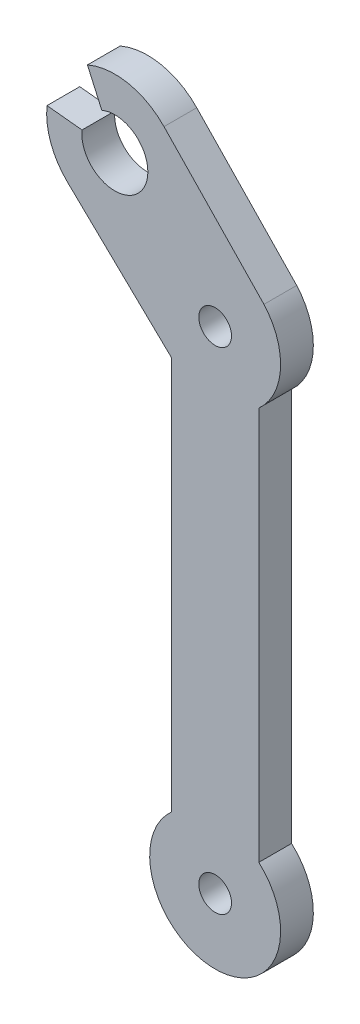
ISO-10303-21;
HEADER;
FILE_DESCRIPTION(('STEP AP214'),'2;1');
FILE_NAME('part.step','',(''),(''),'','','');
FILE_SCHEMA(('AUTOMOTIVE_DESIGN { 1 0 10303 214 1 1 1 1 }'));
ENDSEC;
DATA;
#1=APPLICATION_CONTEXT('core data for automotive mechanical design processes');
#2=APPLICATION_PROTOCOL_DEFINITION('international standard','automotive_design',2000,#1);
#3=PRODUCT_CONTEXT('',#1,'mechanical');
#4=PRODUCT('Part','Part','',(#3));
#5=PRODUCT_RELATED_PRODUCT_CATEGORY('part','',(#4));
#6=PRODUCT_DEFINITION_FORMATION('','',#4);
#7=PRODUCT_DEFINITION_CONTEXT('part definition',#1,'design');
#8=PRODUCT_DEFINITION('design','',#6,#7);
#9=PRODUCT_DEFINITION_SHAPE('','',#8);
#10=(LENGTH_UNIT() NAMED_UNIT(*) SI_UNIT(.MILLI.,.METRE.));
#11=(NAMED_UNIT(*) PLANE_ANGLE_UNIT() SI_UNIT($,.RADIAN.));
#12=(NAMED_UNIT(*) SI_UNIT($,.STERADIAN.) SOLID_ANGLE_UNIT());
#13=UNCERTAINTY_MEASURE_WITH_UNIT(LENGTH_MEASURE(1.E-05),#10,'distance_accuracy_value','');
#14=(GEOMETRIC_REPRESENTATION_CONTEXT(3) GLOBAL_UNCERTAINTY_ASSIGNED_CONTEXT((#13)) GLOBAL_UNIT_ASSIGNED_CONTEXT((#10,
#11,#12)) REPRESENTATION_CONTEXT('',''));
#15=CARTESIAN_POINT('',(0.,0.,0.));
#16=DIRECTION('',(0.,0.,1.));
#17=DIRECTION('',(1.,0.,0.));
#18=AXIS2_PLACEMENT_3D('',#15,#16,#17);
#19=CARTESIAN_POINT('',(13.3453641785926,12.8339301023455,3.));
#20=DIRECTION('',(-0.720783164810605,-0.693160608607852,0.));
#21=DIRECTION('',(0.693160608607852,-0.720783164810606,0.));
#22=AXIS2_PLACEMENT_3D('',#19,#20,#21);
#23=PLANE('',#22);
#24=DIRECTION('',(-0.693160608607852,0.720783164810606,0.));
#25=VECTOR('',#24,1.);
#26=CARTESIAN_POINT('',(13.3453641785926,12.8339301023455,0.));
#27=LINE('',#26,#25);
#28=CARTESIAN_POINT('',(-1.96661843254442,28.7560975609757,0.));
#29=VERTEX_POINT('',#28);
#30=CARTESIAN_POINT('',(-11.1262477629027,38.2807395201999,0.));
#31=VERTEX_POINT('',#30);
#32=EDGE_CURVE('E156',#29,#31,#27,.T.);
#33=ORIENTED_EDGE('',*,*,#32,.T.);
#34=DIRECTION('',(0.,0.,-1.));
#35=VECTOR('',#34,1.);
#36=CARTESIAN_POINT('',(-11.1262477629027,38.2807395201999,3.));
#37=LINE('',#36,#35);
#38=CARTESIAN_POINT('',(-11.1262477629027,38.2807395201999,3.));
#39=VERTEX_POINT('',#38);
#40=EDGE_CURVE('E11',#39,#31,#37,.T.);
#41=ORIENTED_EDGE('',*,*,#40,.F.);
#42=DIRECTION('',(-0.693160608607852,0.720783164810606,0.));
#43=VECTOR('',#42,1.);
#44=CARTESIAN_POINT('',(13.3453641785926,12.8339301023455,3.));
#45=LINE('',#44,#43);
#46=CARTESIAN_POINT('',(-1.96661843254442,28.7560975609757,3.));
#47=VERTEX_POINT('',#46);
#48=EDGE_CURVE('E217',#47,#39,#45,.T.);
#49=ORIENTED_EDGE('',*,*,#48,.F.);
#50=DIRECTION('',(0.,0.,-1.));
#51=VECTOR('',#50,1.);
#52=CARTESIAN_POINT('',(-1.96661843254442,28.7560975609757,3.));
#53=LINE('',#52,#51);
#54=EDGE_CURVE('E146',#47,#29,#53,.T.);
#55=ORIENTED_EDGE('',*,*,#54,.T.);
#56=EDGE_LOOP('',(#33,#41,#49,#55));
#57=FACE_BOUND('',#56,.T.);
#58=ADVANCED_FACE('F35',(#57),#23,.F.);
#59=CARTESIAN_POINT('',(-15.6311425429689,33.9484857164008,3.));
#60=DIRECTION('',(0.,0.,-1.));
#61=DIRECTION('',(-1.,0.,0.));
#62=AXIS2_PLACEMENT_3D('',#59,#60,#61);
#63=CYLINDRICAL_SURFACE('',#62,6.25);
#64=CARTESIAN_POINT('',(-15.6311425429689,33.9484857164008,0.));
#65=DIRECTION('',(0.,0.,1.));
#66=DIRECTION('',(1.,0.,0.));
#67=AXIS2_PLACEMENT_3D('',#64,#65,#66);
#68=CIRCLE('',#67,6.25);
#69=CARTESIAN_POINT('',(-18.1431981071145,39.6714287392384,0.));
#70=VERTEX_POINT('',#69);
#71=EDGE_CURVE('E159',#31,#70,#68,.T.);
#72=ORIENTED_EDGE('',*,*,#71,.T.);
#73=DIRECTION('',(0.,0.,-1.));
#74=VECTOR('',#73,1.);
#75=CARTESIAN_POINT('',(-18.1431981071145,39.6714287392384,3.));
#76=LINE('',#75,#74);
#77=CARTESIAN_POINT('',(-18.1431981071145,39.6714287392384,3.));
#78=VERTEX_POINT('',#77);
#79=EDGE_CURVE('E44',#78,#70,#76,.T.);
#80=ORIENTED_EDGE('',*,*,#79,.F.);
#81=CARTESIAN_POINT('',(-15.6311425429689,33.9484857164008,3.));
#82=DIRECTION('',(0.,0.,1.));
#83=DIRECTION('',(1.,0.,0.));
#84=AXIS2_PLACEMENT_3D('',#81,#82,#83);
#85=CIRCLE('',#84,6.25);
#86=EDGE_CURVE('E104',#39,#78,#85,.T.);
#87=ORIENTED_EDGE('',*,*,#86,.F.);
#88=ORIENTED_EDGE('',*,*,#40,.T.);
#89=EDGE_LOOP('',(#72,#80,#87,#88));
#90=FACE_BOUND('',#89,.T.);
#91=ADVANCED_FACE('F200',(#90),#63,.T.);
#92=CARTESIAN_POINT('',(-0.332401726315656,-0.14867714018544,3.));
#93=DIRECTION('',(-0.912847829342407,-0.408299939339765,0.));
#94=DIRECTION('',(0.408299939339765,-0.912847829342407,0.));
#95=AXIS2_PLACEMENT_3D('',#92,#93,#94);
#96=PLANE('',#95);
#97=DIRECTION('',(-0.408299939339765,0.912847829342407,0.));
#98=VECTOR('',#97,1.);
#99=CARTESIAN_POINT('',(-0.332401726315656,-0.14867714018544,0.));
#100=LINE('',#99,#98);
#101=CARTESIAN_POINT('',(-16.8263647417837,36.7273467952351,0.));
#102=VERTEX_POINT('',#101);
#103=EDGE_CURVE('E162',#102,#70,#100,.T.);
#104=ORIENTED_EDGE('',*,*,#103,.F.);
#105=DIRECTION('',(0.,0.,-1.));
#106=VECTOR('',#105,1.);
#107=CARTESIAN_POINT('',(-16.8263647417837,36.7273467952351,3.));
#108=LINE('',#107,#106);
#109=CARTESIAN_POINT('',(-16.8263647417837,36.7273467952351,3.));
#110=VERTEX_POINT('',#109);
#111=EDGE_CURVE('E193',#110,#102,#108,.T.);
#112=ORIENTED_EDGE('',*,*,#111,.F.);
#113=DIRECTION('',(-0.408299939339765,0.912847829342407,0.));
#114=VECTOR('',#113,1.);
#115=CARTESIAN_POINT('',(-0.332401726315656,-0.14867714018544,3.));
#116=LINE('',#115,#114);
#117=EDGE_CURVE('E199',#110,#78,#116,.T.);
#118=ORIENTED_EDGE('',*,*,#117,.T.);
#119=ORIENTED_EDGE('',*,*,#79,.T.);
#120=EDGE_LOOP('',(#104,#112,#118,#119));
#121=FACE_BOUND('',#120,.T.);
#122=ADVANCED_FACE('F197',(#121),#96,.T.);
#123=CARTESIAN_POINT('',(-15.6311425429689,33.9484857164008,3.));
#124=DIRECTION('',(0.,0.,-1.));
#125=DIRECTION('',(-1.,0.,0.));
#126=AXIS2_PLACEMENT_3D('',#123,#124,#125);
#127=CYLINDRICAL_SURFACE('',#126,3.025);
#128=CARTESIAN_POINT('',(-15.6311425429689,33.9484857164008,0.));
#129=DIRECTION('',(0.,0.,1.));
#130=DIRECTION('',(1.,0.,0.));
#131=AXIS2_PLACEMENT_3D('',#128,#129,#130);
#132=CIRCLE('',#131,3.025);
#133=CARTESIAN_POINT('',(-18.6401081664704,34.2595337457897,0.));
#134=VERTEX_POINT('',#133);
#135=EDGE_CURVE('E166',#134,#102,#132,.T.);
#136=ORIENTED_EDGE('',*,*,#135,.F.);
#137=DIRECTION('',(0.,0.,-1.));
#138=VECTOR('',#137,1.);
#139=CARTESIAN_POINT('',(-18.6401081664704,34.2595337457897,3.));
#140=LINE('',#139,#138);
#141=CARTESIAN_POINT('',(-18.6401081664704,34.2595337457897,3.));
#142=VERTEX_POINT('',#141);
#143=EDGE_CURVE('E191',#142,#134,#140,.T.);
#144=ORIENTED_EDGE('',*,*,#143,.F.);
#145=CARTESIAN_POINT('',(-15.6311425429689,33.9484857164008,3.));
#146=DIRECTION('',(0.,0.,1.));
#147=DIRECTION('',(1.,0.,0.));
#148=AXIS2_PLACEMENT_3D('',#145,#146,#147);
#149=CIRCLE('',#148,3.025);
#150=EDGE_CURVE('E213',#142,#110,#149,.T.);
#151=ORIENTED_EDGE('',*,*,#150,.T.);
#152=ORIENTED_EDGE('',*,*,#111,.T.);
#153=EDGE_LOOP('',(#136,#144,#151,#152));
#154=FACE_BOUND('',#153,.T.);
#155=ADVANCED_FACE('F209',(#154),#127,.F.);
#156=CARTESIAN_POINT('',(3.30700640548946,31.9907784349738,3.));
#157=DIRECTION('',(-0.102825794839319,-0.994699379669889,0.));
#158=DIRECTION('',(0.994699379669889,-0.102825794839319,0.));
#159=AXIS2_PLACEMENT_3D('',#156,#157,#158);
#160=PLANE('',#159);
#161=DIRECTION('',(-0.994699379669889,0.102825794839319,0.));
#162=VECTOR('',#161,1.);
#163=CARTESIAN_POINT('',(3.30700640548946,31.9907784349738,0.));
#164=LINE('',#163,#162);
#165=CARTESIAN_POINT('',(-21.8480136659058,34.5911469341465,0.));
#166=VERTEX_POINT('',#165);
#167=EDGE_CURVE('E169',#134,#166,#164,.T.);
#168=ORIENTED_EDGE('',*,*,#167,.T.);
#169=DIRECTION('',(0.,0.,-1.));
#170=VECTOR('',#169,1.);
#171=CARTESIAN_POINT('',(-21.8480136659058,34.5911469341465,3.));
#172=LINE('',#171,#170);
#173=CARTESIAN_POINT('',(-21.8480136659058,34.5911469341465,3.));
#174=VERTEX_POINT('',#173);
#175=EDGE_CURVE('E188',#174,#166,#172,.T.);
#176=ORIENTED_EDGE('',*,*,#175,.F.);
#177=DIRECTION('',(-0.994699379669889,0.102825794839319,0.));
#178=VECTOR('',#177,1.);
#179=CARTESIAN_POINT('',(3.30700640548946,31.9907784349738,3.));
#180=LINE('',#179,#178);
#181=EDGE_CURVE('E215',#142,#174,#180,.T.);
#182=ORIENTED_EDGE('',*,*,#181,.F.);
#183=ORIENTED_EDGE('',*,*,#143,.T.);
#184=EDGE_LOOP('',(#168,#176,#182,#183));
#185=FACE_BOUND('',#184,.T.);
#186=ADVANCED_FACE('F330',(#185),#160,.F.);
#187=CARTESIAN_POINT('',(-19.9633963467681,29.4435909363345,0.));
#188=VERTEX_POINT('',#187);
#189=EDGE_CURVE('E163',#166,#188,#68,.T.);
#190=ORIENTED_EDGE('',*,*,#189,.T.);
#191=DIRECTION('',(0.,0.,-1.));
#192=VECTOR('',#191,1.);
#193=CARTESIAN_POINT('',(-19.9633963467681,29.4435909363345,3.));
#194=LINE('',#193,#192);
#195=CARTESIAN_POINT('',(-19.9633963467681,29.4435909363345,3.));
#196=VERTEX_POINT('',#195);
#197=EDGE_CURVE('E186',#196,#188,#194,.T.);
#198=ORIENTED_EDGE('',*,*,#197,.F.);
#199=EDGE_CURVE('E219',#174,#196,#85,.T.);
#200=ORIENTED_EDGE('',*,*,#199,.F.);
#201=ORIENTED_EDGE('',*,*,#175,.T.);
#202=EDGE_LOOP('',(#190,#198,#200,#201));
#203=FACE_BOUND('',#202,.T.);
#204=ADVANCED_FACE('F250',(#203),#63,.T.);
#205=CARTESIAN_POINT('',(5.11871708601377,5.32269874428819,3.));
#206=DIRECTION('',(-0.693160608607859,-0.720783164810598,0.));
#207=DIRECTION('',(0.720783164810598,-0.693160608607859,0.));
#208=AXIS2_PLACEMENT_3D('',#205,#206,#207);
#209=PLANE('',#208);
#210=DIRECTION('',(-0.720783164810598,0.693160608607859,0.));
#211=VECTOR('',#210,1.);
#212=CARTESIAN_POINT('',(5.11871708601377,5.32269874428819,0.));
#213=LINE('',#212,#211);
#214=CARTESIAN_POINT('',(-10.438754387544,20.2839616059761,0.));
#215=VERTEX_POINT('',#214);
#216=EDGE_CURVE('E171',#215,#188,#213,.T.);
#217=ORIENTED_EDGE('',*,*,#216,.F.);
#218=DIRECTION('',(0.,0.,-1.));
#219=VECTOR('',#218,1.);
#220=CARTESIAN_POINT('',(-10.438754387544,20.2839616059761,3.));
#221=LINE('',#220,#219);
#222=CARTESIAN_POINT('',(-10.438754387544,20.2839616059761,3.));
#223=VERTEX_POINT('',#222);
#224=EDGE_CURVE('E184',#223,#215,#221,.T.);
#225=ORIENTED_EDGE('',*,*,#224,.F.);
#226=DIRECTION('',(-0.720783164810598,0.693160608607859,0.));
#227=VECTOR('',#226,1.);
#228=CARTESIAN_POINT('',(5.11871708601377,5.32269874428819,3.));
#229=LINE('',#228,#227);
#230=EDGE_CURVE('E223',#223,#196,#229,.T.);
#231=ORIENTED_EDGE('',*,*,#230,.T.);
#232=ORIENTED_EDGE('',*,*,#197,.T.);
#233=EDGE_LOOP('',(#217,#225,#231,#232));
#234=FACE_BOUND('',#233,.T.);
#235=ADVANCED_FACE('F311',(#234),#209,.T.);
#236=CARTESIAN_POINT('',(-10.4387543875439,0.,3.));
#237=DIRECTION('',(-1.,0.,0.));
#238=DIRECTION('',(0.,-1.,0.));
#239=AXIS2_PLACEMENT_3D('',#236,#237,#238);
#240=PLANE('',#239);
#241=DIRECTION('',(0.,1.,0.));
#242=VECTOR('',#241,1.);
#243=CARTESIAN_POINT('',(-10.4387543875439,0.,0.));
#244=LINE('',#243,#242);
#245=CARTESIAN_POINT('',(-10.4387543875439,-15.7717664840248,0.));
#246=VERTEX_POINT('',#245);
#247=EDGE_CURVE('E174',#246,#215,#244,.T.);
#248=ORIENTED_EDGE('',*,*,#247,.F.);
#249=DIRECTION('',(0.,0.,-1.));
#250=VECTOR('',#249,1.);
#251=CARTESIAN_POINT('',(-10.4387543875439,-15.7717664840248,3.));
#252=LINE('',#251,#250);
#253=CARTESIAN_POINT('',(-10.4387543875439,-15.7717664840248,3.));
#254=VERTEX_POINT('',#253);
#255=EDGE_CURVE('E141',#254,#246,#252,.T.);
#256=ORIENTED_EDGE('',*,*,#255,.F.);
#257=DIRECTION('',(0.,1.,0.));
#258=VECTOR('',#257,1.);
#259=CARTESIAN_POINT('',(-10.4387543875439,0.,3.));
#260=LINE('',#259,#258);
#261=EDGE_CURVE('E134',#254,#223,#260,.T.);
#262=ORIENTED_EDGE('',*,*,#261,.T.);
#263=ORIENTED_EDGE('',*,*,#224,.T.);
#264=EDGE_LOOP('',(#248,#256,#262,#263));
#265=FACE_BOUND('',#264,.T.);
#266=ADVANCED_FACE('F227',(#265),#240,.T.);
#267=CARTESIAN_POINT('',(-6.43875438754387,-20.2439024390244,3.));
#268=DIRECTION('',(0.,0.,-1.));
#269=DIRECTION('',(-1.,0.,0.));
#270=AXIS2_PLACEMENT_3D('',#267,#268,#269);
#271=CYLINDRICAL_SURFACE('',#270,6.);
#272=CARTESIAN_POINT('',(-6.43875438754387,-20.2439024390244,0.));
#273=DIRECTION('',(0.,0.,1.));
#274=DIRECTION('',(1.,0.,0.));
#275=AXIS2_PLACEMENT_3D('',#272,#273,#274);
#276=CIRCLE('',#275,6.);
#277=CARTESIAN_POINT('',(-2.43875438754387,-15.7717664840248,0.));
#278=VERTEX_POINT('',#277);
#279=EDGE_CURVE('E140',#246,#278,#276,.T.);
#280=ORIENTED_EDGE('',*,*,#279,.T.);
#281=DIRECTION('',(0.,0.,-1.));
#282=VECTOR('',#281,1.);
#283=CARTESIAN_POINT('',(-2.43875438754387,-15.7717664840248,3.));
#284=LINE('',#283,#282);
#285=CARTESIAN_POINT('',(-2.43875438754387,-15.7717664840248,3.));
#286=VERTEX_POINT('',#285);
#287=EDGE_CURVE('E137',#286,#278,#284,.T.);
#288=ORIENTED_EDGE('',*,*,#287,.F.);
#289=CARTESIAN_POINT('',(-6.43875438754387,-20.2439024390244,3.));
#290=DIRECTION('',(0.,0.,1.));
#291=DIRECTION('',(1.,0.,0.));
#292=AXIS2_PLACEMENT_3D('',#289,#290,#291);
#293=CIRCLE('',#292,6.);
#294=EDGE_CURVE('E127',#254,#286,#293,.T.);
#295=ORIENTED_EDGE('',*,*,#294,.F.);
#296=ORIENTED_EDGE('',*,*,#255,.T.);
#297=EDGE_LOOP('',(#280,#288,#295,#296));
#298=FACE_BOUND('',#297,.T.);
#299=ADVANCED_FACE('F138',(#298),#271,.T.);
#300=CARTESIAN_POINT('',(-2.43875438754387,0.,3.));
#301=DIRECTION('',(-1.,0.,0.));
#302=DIRECTION('',(0.,0.,1.));
#303=AXIS2_PLACEMENT_3D('',#300,#301,#302);
#304=PLANE('',#303);
#305=DIRECTION('',(0.,1.,0.));
#306=VECTOR('',#305,1.);
#307=CARTESIAN_POINT('',(-2.43875438754387,0.,0.));
#308=LINE('',#307,#306);
#309=CARTESIAN_POINT('',(-2.43875438754387,20.283961605976,0.));
#310=VERTEX_POINT('',#309);
#311=EDGE_CURVE('E90',#278,#310,#308,.T.);
#312=ORIENTED_EDGE('',*,*,#311,.T.);
#313=DIRECTION('',(0.,0.,-1.));
#314=VECTOR('',#313,1.);
#315=CARTESIAN_POINT('',(-2.43875438754387,20.283961605976,3.));
#316=LINE('',#315,#314);
#317=CARTESIAN_POINT('',(-2.43875438754387,20.283961605976,3.));
#318=VERTEX_POINT('',#317);
#319=EDGE_CURVE('E142',#318,#310,#316,.T.);
#320=ORIENTED_EDGE('',*,*,#319,.F.);
#321=DIRECTION('',(0.,1.,0.));
#322=VECTOR('',#321,1.);
#323=CARTESIAN_POINT('',(-2.43875438754387,0.,3.));
#324=LINE('',#323,#322);
#325=EDGE_CURVE('E131',#286,#318,#324,.T.);
#326=ORIENTED_EDGE('',*,*,#325,.F.);
#327=ORIENTED_EDGE('',*,*,#287,.T.);
#328=EDGE_LOOP('',(#312,#320,#326,#327));
#329=FACE_BOUND('',#328,.T.);
#330=ADVANCED_FACE('F144',(#329),#304,.F.);
#331=CARTESIAN_POINT('',(-6.43875438754387,-20.2439024390244,3.));
#332=DIRECTION('',(0.,0.,-1.));
#333=DIRECTION('',(-1.,0.,0.));
#334=AXIS2_PLACEMENT_3D('',#331,#332,#333);
#335=CYLINDRICAL_SURFACE('',#334,1.5);
#336=CARTESIAN_POINT('',(-6.43875438754387,-20.2439024390244,3.));
#337=DIRECTION('',(0.,0.,1.));
#338=DIRECTION('',(1.,0.,0.));
#339=AXIS2_PLACEMENT_3D('',#336,#337,#338);
#340=CIRCLE('',#339,1.5);
#341=CARTESIAN_POINT('',(-4.93875438754387,-20.2439024390244,3.));
#342=VERTEX_POINT('',#341);
#343=EDGE_CURVE('E261',#342,#342,#340,.T.);
#344=ORIENTED_EDGE('',*,*,#343,.T.);
#345=EDGE_LOOP('',(#344));
#346=FACE_BOUND('',#345,.T.);
#347=CARTESIAN_POINT('',(-6.43875438754387,-20.2439024390244,0.));
#348=DIRECTION('',(0.,0.,1.));
#349=DIRECTION('',(1.,0.,0.));
#350=AXIS2_PLACEMENT_3D('',#347,#348,#349);
#351=CIRCLE('',#350,1.5);
#352=CARTESIAN_POINT('',(-4.93875438754387,-20.2439024390244,0.));
#353=VERTEX_POINT('',#352);
#354=EDGE_CURVE('E153',#353,#353,#351,.T.);
#355=ORIENTED_EDGE('',*,*,#354,.F.);
#356=EDGE_LOOP('',(#355));
#357=FACE_BOUND('',#356,.T.);
#358=ADVANCED_FACE('F240',(#346,#357),#335,.F.);
#359=CARTESIAN_POINT('',(-6.4387543875439,24.7560975609756,3.));
#360=DIRECTION('',(0.,0.,-1.));
#361=DIRECTION('',(-1.,0.,0.));
#362=AXIS2_PLACEMENT_3D('',#359,#360,#361);
#363=CYLINDRICAL_SURFACE('',#362,1.50000000000002);
#364=CARTESIAN_POINT('',(-6.4387543875439,24.7560975609756,3.));
#365=DIRECTION('',(0.,0.,1.));
#366=DIRECTION('',(1.,0.,0.));
#367=AXIS2_PLACEMENT_3D('',#364,#365,#366);
#368=CIRCLE('',#367,1.50000000000002);
#369=CARTESIAN_POINT('',(-4.93875438754388,24.7560975609756,3.));
#370=VERTEX_POINT('',#369);
#371=EDGE_CURVE('E180',#370,#370,#368,.T.);
#372=ORIENTED_EDGE('',*,*,#371,.T.);
#373=EDGE_LOOP('',(#372));
#374=FACE_BOUND('',#373,.T.);
#375=CARTESIAN_POINT('',(-6.4387543875439,24.7560975609756,0.));
#376=DIRECTION('',(0.,0.,1.));
#377=DIRECTION('',(1.,0.,0.));
#378=AXIS2_PLACEMENT_3D('',#375,#376,#377);
#379=CIRCLE('',#378,1.50000000000002);
#380=CARTESIAN_POINT('',(-4.93875438754388,24.7560975609756,0.));
#381=VERTEX_POINT('',#380);
#382=EDGE_CURVE('E150',#381,#381,#379,.T.);
#383=ORIENTED_EDGE('',*,*,#382,.F.);
#384=EDGE_LOOP('',(#383));
#385=FACE_BOUND('',#384,.T.);
#386=ADVANCED_FACE('F37',(#374,#385),#363,.F.);
#387=CARTESIAN_POINT('',(-6.4387543875439,24.7560975609756,3.));
#388=DIRECTION('',(0.,0.,-1.));
#389=DIRECTION('',(-1.,0.,0.));
#390=AXIS2_PLACEMENT_3D('',#387,#388,#389);
#391=CYLINDRICAL_SURFACE('',#390,6.00000000000002);
#392=CARTESIAN_POINT('',(-6.4387543875439,24.7560975609756,0.));
#393=DIRECTION('',(0.,0.,1.));
#394=DIRECTION('',(1.,0.,0.));
#395=AXIS2_PLACEMENT_3D('',#392,#393,#394);
#396=CIRCLE('',#395,6.00000000000002);
#397=EDGE_CURVE('E96',#310,#29,#396,.T.);
#398=ORIENTED_EDGE('',*,*,#397,.T.);
#399=ORIENTED_EDGE('',*,*,#54,.F.);
#400=CARTESIAN_POINT('',(-6.4387543875439,24.7560975609756,3.));
#401=DIRECTION('',(0.,0.,1.));
#402=DIRECTION('',(1.,0.,0.));
#403=AXIS2_PLACEMENT_3D('',#400,#401,#402);
#404=CIRCLE('',#403,6.00000000000002);
#405=EDGE_CURVE('E52',#318,#47,#404,.T.);
#406=ORIENTED_EDGE('',*,*,#405,.F.);
#407=ORIENTED_EDGE('',*,*,#319,.T.);
#408=EDGE_LOOP('',(#398,#399,#406,#407));
#409=FACE_BOUND('',#408,.T.);
#410=ADVANCED_FACE('F231',(#409),#391,.T.);
#411=CARTESIAN_POINT('',(0.,0.,3.));
#412=DIRECTION('',(0.,0.,1.));
#413=DIRECTION('',(1.,0.,0.));
#414=AXIS2_PLACEMENT_3D('',#411,#412,#413);
#415=PLANE('',#414);
#416=ORIENTED_EDGE('',*,*,#371,.F.);
#417=EDGE_LOOP('',(#416));
#418=FACE_BOUND('',#417,.T.);
#419=ORIENTED_EDGE('',*,*,#343,.F.);
#420=EDGE_LOOP('',(#419));
#421=FACE_BOUND('',#420,.T.);
#422=ORIENTED_EDGE('',*,*,#48,.T.);
#423=ORIENTED_EDGE('',*,*,#86,.T.);
#424=ORIENTED_EDGE('',*,*,#117,.F.);
#425=ORIENTED_EDGE('',*,*,#150,.F.);
#426=ORIENTED_EDGE('',*,*,#181,.T.);
#427=ORIENTED_EDGE('',*,*,#199,.T.);
#428=ORIENTED_EDGE('',*,*,#230,.F.);
#429=ORIENTED_EDGE('',*,*,#261,.F.);
#430=ORIENTED_EDGE('',*,*,#294,.T.);
#431=ORIENTED_EDGE('',*,*,#325,.T.);
#432=ORIENTED_EDGE('',*,*,#405,.T.);
#433=EDGE_LOOP('',(#422,#423,#424,#425,#426,#427,#428,#429,#430,#431,#432));
#434=FACE_BOUND('',#433,.T.);
#435=ADVANCED_FACE('F129',(#418,#421,#434),#415,.T.);
#436=CARTESIAN_POINT('',(0.,0.,0.));
#437=DIRECTION('',(0.,0.,1.));
#438=DIRECTION('',(1.,0.,0.));
#439=AXIS2_PLACEMENT_3D('',#436,#437,#438);
#440=PLANE('',#439);
#441=ORIENTED_EDGE('',*,*,#382,.T.);
#442=EDGE_LOOP('',(#441));
#443=FACE_BOUND('',#442,.T.);
#444=ORIENTED_EDGE('',*,*,#354,.T.);
#445=EDGE_LOOP('',(#444));
#446=FACE_BOUND('',#445,.T.);
#447=ORIENTED_EDGE('',*,*,#32,.F.);
#448=ORIENTED_EDGE('',*,*,#397,.F.);
#449=ORIENTED_EDGE('',*,*,#311,.F.);
#450=ORIENTED_EDGE('',*,*,#279,.F.);
#451=ORIENTED_EDGE('',*,*,#247,.T.);
#452=ORIENTED_EDGE('',*,*,#216,.T.);
#453=ORIENTED_EDGE('',*,*,#189,.F.);
#454=ORIENTED_EDGE('',*,*,#167,.F.);
#455=ORIENTED_EDGE('',*,*,#135,.T.);
#456=ORIENTED_EDGE('',*,*,#103,.T.);
#457=ORIENTED_EDGE('',*,*,#71,.F.);
#458=EDGE_LOOP('',(#447,#448,#449,#450,#451,#452,#453,#454,#455,#456,#457));
#459=FACE_BOUND('',#458,.T.);
#460=ADVANCED_FACE('F204',(#443,#446,#459),#440,.F.);
#461=CLOSED_SHELL('',(#58,#91,#122,#155,#186,#204,#235,#266,#299,#330,#358,#386,#410,#435,#460));
#462=MANIFOLD_SOLID_BREP('B2',#461);
#463=ADVANCED_BREP_SHAPE_REPRESENTATION('',(#18,#462),#14);
#464=SHAPE_DEFINITION_REPRESENTATION(#9,#463);
ENDSEC;
END-ISO-10303-21;
